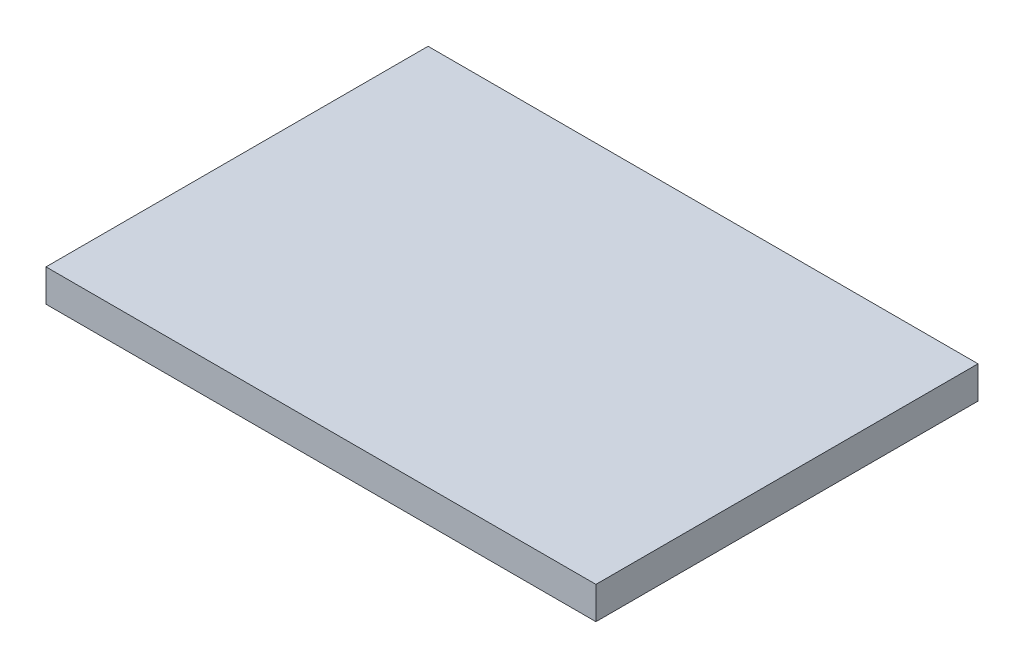
ISO-10303-21;
HEADER;
FILE_DESCRIPTION(('STEP AP214'),'2;1');
FILE_NAME('part.step','',(''),(''),'','','');
FILE_SCHEMA(('AUTOMOTIVE_DESIGN { 1 0 10303 214 1 1 1 1 }'));
ENDSEC;
DATA;
#1=APPLICATION_CONTEXT('core data for automotive mechanical design processes');
#2=APPLICATION_PROTOCOL_DEFINITION('international standard','automotive_design',2000,#1);
#3=PRODUCT_CONTEXT('',#1,'mechanical');
#4=PRODUCT('Part','Part','',(#3));
#5=PRODUCT_RELATED_PRODUCT_CATEGORY('part','',(#4));
#6=PRODUCT_DEFINITION_FORMATION('','',#4);
#7=PRODUCT_DEFINITION_CONTEXT('part definition',#1,'design');
#8=PRODUCT_DEFINITION('design','',#6,#7);
#9=PRODUCT_DEFINITION_SHAPE('','',#8);
#10=(LENGTH_UNIT() NAMED_UNIT(*) SI_UNIT(.MILLI.,.METRE.));
#11=(NAMED_UNIT(*) PLANE_ANGLE_UNIT() SI_UNIT($,.RADIAN.));
#12=(NAMED_UNIT(*) SI_UNIT($,.STERADIAN.) SOLID_ANGLE_UNIT());
#13=UNCERTAINTY_MEASURE_WITH_UNIT(LENGTH_MEASURE(1.E-05),#10,'distance_accuracy_value','');
#14=(GEOMETRIC_REPRESENTATION_CONTEXT(3) GLOBAL_UNCERTAINTY_ASSIGNED_CONTEXT((#13)) GLOBAL_UNIT_ASSIGNED_CONTEXT((#10,
#11,#12)) REPRESENTATION_CONTEXT('',''));
#15=CARTESIAN_POINT('',(0.,0.,0.));
#16=DIRECTION('',(0.,0.,1.));
#17=DIRECTION('',(1.,0.,0.));
#18=AXIS2_PLACEMENT_3D('',#15,#16,#17);
#19=CARTESIAN_POINT('',(-1.0795,0.06349999999998,1.50000208));
#20=DIRECTION('',(0.,0.,-1.));
#21=DIRECTION('',(0.,-1.,0.));
#22=AXIS2_PLACEMENT_3D('',#19,#20,#21);
#23=PLANE('',#22);
#24=DIRECTION('',(0.,-1.,0.));
#25=VECTOR('',#24,1.);
#26=CARTESIAN_POINT('',(-1.0795,0.06349999999998,1.50000208));
#27=LINE('',#26,#25);
#28=CARTESIAN_POINT('',(-1.0795,0.06349999999998,1.50000208));
#29=VERTEX_POINT('',#28);
#30=CARTESIAN_POINT('',(-1.0795,-0.06349999999998,1.50000208));
#31=VERTEX_POINT('',#30);
#32=EDGE_CURVE('E90',#29,#31,#27,.T.);
#33=ORIENTED_EDGE('',*,*,#32,.T.);
#34=DIRECTION('',(1.,0.,0.));
#35=VECTOR('',#34,1.);
#36=CARTESIAN_POINT('',(-1.0795,-0.06349999999998,1.50000208));
#37=LINE('',#36,#35);
#38=CARTESIAN_POINT('',(1.0795,-0.06349999999998,1.50000208));
#39=VERTEX_POINT('',#38);
#40=EDGE_CURVE('E68',#31,#39,#37,.T.);
#41=ORIENTED_EDGE('',*,*,#40,.T.);
#42=DIRECTION('',(0.,1.,0.));
#43=VECTOR('',#42,1.);
#44=CARTESIAN_POINT('',(1.0795,-0.06349999999998,1.50000208));
#45=LINE('',#44,#43);
#46=CARTESIAN_POINT('',(1.0795,0.06349999999998,1.50000208));
#47=VERTEX_POINT('',#46);
#48=EDGE_CURVE('E84',#39,#47,#45,.T.);
#49=ORIENTED_EDGE('',*,*,#48,.T.);
#50=DIRECTION('',(-1.,0.,0.));
#51=VECTOR('',#50,1.);
#52=CARTESIAN_POINT('',(1.0795,0.06349999999998,1.50000208));
#53=LINE('',#52,#51);
#54=EDGE_CURVE('E11',#47,#29,#53,.T.);
#55=ORIENTED_EDGE('',*,*,#54,.T.);
#56=EDGE_LOOP('',(#33,#41,#49,#55));
#57=FACE_BOUND('',#56,.T.);
#58=ADVANCED_FACE('F17',(#57),#23,.F.);
#59=CARTESIAN_POINT('',(-1.0795,0.06349999999998,0.));
#60=DIRECTION('',(0.,0.,-1.));
#61=DIRECTION('',(0.,-1.,0.));
#62=AXIS2_PLACEMENT_3D('',#59,#60,#61);
#63=PLANE('',#62);
#64=DIRECTION('',(-1.,0.,0.));
#65=VECTOR('',#64,1.);
#66=CARTESIAN_POINT('',(1.0795,0.06349999999998,0.));
#67=LINE('',#66,#65);
#68=CARTESIAN_POINT('',(1.0795,0.06349999999998,0.));
#69=VERTEX_POINT('',#68);
#70=CARTESIAN_POINT('',(-1.0795,0.06349999999998,0.));
#71=VERTEX_POINT('',#70);
#72=EDGE_CURVE('E26',#69,#71,#67,.T.);
#73=ORIENTED_EDGE('',*,*,#72,.F.);
#74=DIRECTION('',(0.,1.,0.));
#75=VECTOR('',#74,1.);
#76=CARTESIAN_POINT('',(1.0795,-0.06349999999998,0.));
#77=LINE('',#76,#75);
#78=CARTESIAN_POINT('',(1.0795,-0.06349999999998,0.));
#79=VERTEX_POINT('',#78);
#80=EDGE_CURVE('E52',#79,#69,#77,.T.);
#81=ORIENTED_EDGE('',*,*,#80,.F.);
#82=DIRECTION('',(1.,0.,0.));
#83=VECTOR('',#82,1.);
#84=CARTESIAN_POINT('',(-1.0795,-0.06349999999998,0.));
#85=LINE('',#84,#83);
#86=CARTESIAN_POINT('',(-1.0795,-0.06349999999998,0.));
#87=VERTEX_POINT('',#86);
#88=EDGE_CURVE('E92',#87,#79,#85,.T.);
#89=ORIENTED_EDGE('',*,*,#88,.F.);
#90=DIRECTION('',(0.,-1.,0.));
#91=VECTOR('',#90,1.);
#92=CARTESIAN_POINT('',(-1.0795,0.06349999999998,0.));
#93=LINE('',#92,#91);
#94=EDGE_CURVE('E89',#71,#87,#93,.T.);
#95=ORIENTED_EDGE('',*,*,#94,.F.);
#96=EDGE_LOOP('',(#73,#81,#89,#95));
#97=FACE_BOUND('',#96,.T.);
#98=ADVANCED_FACE('F94',(#97),#63,.T.);
#99=CARTESIAN_POINT('',(1.0795,0.06349999999998,0.));
#100=DIRECTION('',(0.,-1.,0.));
#101=DIRECTION('',(0.,0.,-1.));
#102=AXIS2_PLACEMENT_3D('',#99,#100,#101);
#103=PLANE('',#102);
#104=ORIENTED_EDGE('',*,*,#72,.T.);
#105=DIRECTION('',(0.,0.,1.));
#106=VECTOR('',#105,1.);
#107=CARTESIAN_POINT('',(-1.0795,0.06349999999998,0.));
#108=LINE('',#107,#106);
#109=EDGE_CURVE('E78',#71,#29,#108,.T.);
#110=ORIENTED_EDGE('',*,*,#109,.T.);
#111=ORIENTED_EDGE('',*,*,#54,.F.);
#112=DIRECTION('',(0.,0.,1.));
#113=VECTOR('',#112,1.);
#114=CARTESIAN_POINT('',(1.0795,0.06349999999998,0.));
#115=LINE('',#114,#113);
#116=EDGE_CURVE('E81',#69,#47,#115,.T.);
#117=ORIENTED_EDGE('',*,*,#116,.F.);
#118=EDGE_LOOP('',(#104,#110,#111,#117));
#119=FACE_BOUND('',#118,.T.);
#120=ADVANCED_FACE('F77',(#119),#103,.F.);
#121=CARTESIAN_POINT('',(1.0795,-0.06349999999998,0.));
#122=DIRECTION('',(-1.,0.,0.));
#123=DIRECTION('',(0.,0.,1.));
#124=AXIS2_PLACEMENT_3D('',#121,#122,#123);
#125=PLANE('',#124);
#126=ORIENTED_EDGE('',*,*,#80,.T.);
#127=ORIENTED_EDGE('',*,*,#116,.T.);
#128=ORIENTED_EDGE('',*,*,#48,.F.);
#129=DIRECTION('',(0.,0.,1.));
#130=VECTOR('',#129,1.);
#131=CARTESIAN_POINT('',(1.0795,-0.06349999999998,0.));
#132=LINE('',#131,#130);
#133=EDGE_CURVE('E109',#79,#39,#132,.T.);
#134=ORIENTED_EDGE('',*,*,#133,.F.);
#135=EDGE_LOOP('',(#126,#127,#128,#134));
#136=FACE_BOUND('',#135,.T.);
#137=ADVANCED_FACE('F122',(#136),#125,.F.);
#138=CARTESIAN_POINT('',(-1.0795,-0.06349999999998,0.));
#139=DIRECTION('',(0.,1.,0.));
#140=DIRECTION('',(1.,0.,0.));
#141=AXIS2_PLACEMENT_3D('',#138,#139,#140);
#142=PLANE('',#141);
#143=ORIENTED_EDGE('',*,*,#88,.T.);
#144=ORIENTED_EDGE('',*,*,#133,.T.);
#145=ORIENTED_EDGE('',*,*,#40,.F.);
#146=DIRECTION('',(0.,0.,1.));
#147=VECTOR('',#146,1.);
#148=CARTESIAN_POINT('',(-1.0795,-0.06349999999998,0.));
#149=LINE('',#148,#147);
#150=EDGE_CURVE('E97',#87,#31,#149,.T.);
#151=ORIENTED_EDGE('',*,*,#150,.F.);
#152=EDGE_LOOP('',(#143,#144,#145,#151));
#153=FACE_BOUND('',#152,.T.);
#154=ADVANCED_FACE('F123',(#153),#142,.F.);
#155=CARTESIAN_POINT('',(-1.0795,0.06349999999998,0.));
#156=DIRECTION('',(1.,0.,0.));
#157=DIRECTION('',(0.,1.,0.));
#158=AXIS2_PLACEMENT_3D('',#155,#156,#157);
#159=PLANE('',#158);
#160=ORIENTED_EDGE('',*,*,#94,.T.);
#161=ORIENTED_EDGE('',*,*,#150,.T.);
#162=ORIENTED_EDGE('',*,*,#32,.F.);
#163=ORIENTED_EDGE('',*,*,#109,.F.);
#164=EDGE_LOOP('',(#160,#161,#162,#163));
#165=FACE_BOUND('',#164,.T.);
#166=ADVANCED_FACE('F87',(#165),#159,.F.);
#167=CLOSED_SHELL('',(#58,#98,#120,#137,#154,#166));
#168=MANIFOLD_SOLID_BREP('B1',#167);
#169=ADVANCED_BREP_SHAPE_REPRESENTATION('',(#18,#168),#14);
#170=SHAPE_DEFINITION_REPRESENTATION(#9,#169);
ENDSEC;
END-ISO-10303-21;
